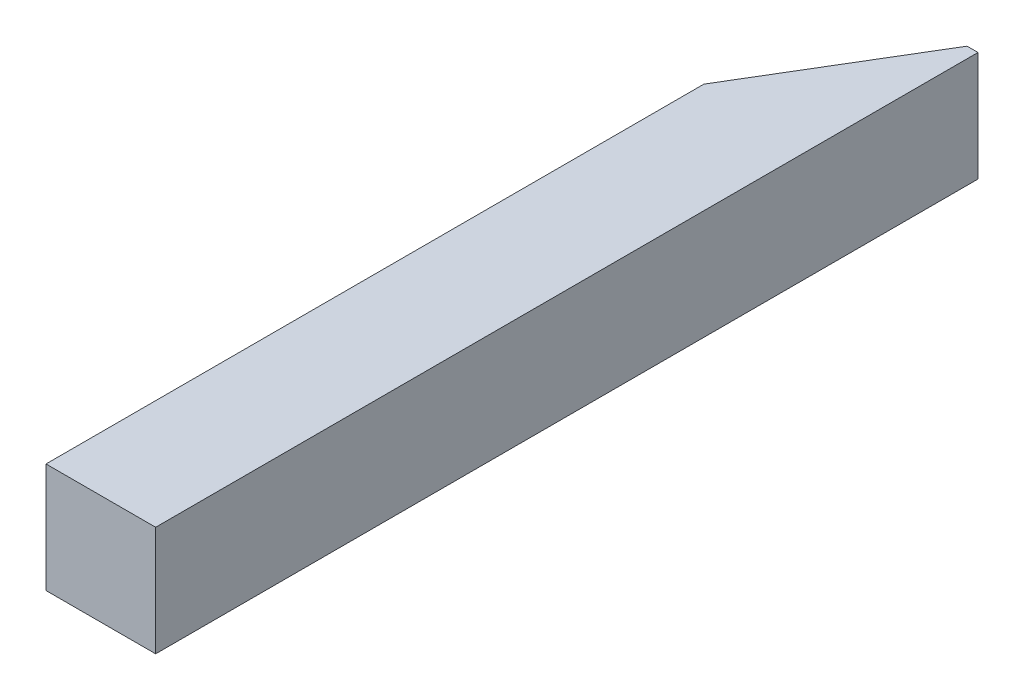
ISO-10303-21;
HEADER;
FILE_DESCRIPTION(('STEP AP214'),'2;1');
FILE_NAME('part.step','',(''),(''),'','','');
FILE_SCHEMA(('AUTOMOTIVE_DESIGN { 1 0 10303 214 1 1 1 1 }'));
ENDSEC;
DATA;
#1=APPLICATION_CONTEXT('core data for automotive mechanical design processes');
#2=APPLICATION_PROTOCOL_DEFINITION('international standard','automotive_design',2000,#1);
#3=PRODUCT_CONTEXT('',#1,'mechanical');
#4=PRODUCT('Part','Part','',(#3));
#5=PRODUCT_RELATED_PRODUCT_CATEGORY('part','',(#4));
#6=PRODUCT_DEFINITION_FORMATION('','',#4);
#7=PRODUCT_DEFINITION_CONTEXT('part definition',#1,'design');
#8=PRODUCT_DEFINITION('design','',#6,#7);
#9=PRODUCT_DEFINITION_SHAPE('','',#8);
#10=(LENGTH_UNIT() NAMED_UNIT(*) SI_UNIT(.MILLI.,.METRE.));
#11=(NAMED_UNIT(*) PLANE_ANGLE_UNIT() SI_UNIT($,.RADIAN.));
#12=(NAMED_UNIT(*) SI_UNIT($,.STERADIAN.) SOLID_ANGLE_UNIT());
#13=UNCERTAINTY_MEASURE_WITH_UNIT(LENGTH_MEASURE(1.E-05),#10,'distance_accuracy_value','');
#14=(GEOMETRIC_REPRESENTATION_CONTEXT(3) GLOBAL_UNCERTAINTY_ASSIGNED_CONTEXT((#13)) GLOBAL_UNIT_ASSIGNED_CONTEXT((#10,
#11,#12)) REPRESENTATION_CONTEXT('',''));
#15=CARTESIAN_POINT('',(0.,0.,0.));
#16=DIRECTION('',(0.,0.,1.));
#17=DIRECTION('',(1.,0.,0.));
#18=AXIS2_PLACEMENT_3D('',#15,#16,#17);
#19=CARTESIAN_POINT('',(0.,0.,150.));
#20=DIRECTION('',(1.,0.,0.));
#21=DIRECTION('',(0.,1.,0.));
#22=AXIS2_PLACEMENT_3D('',#19,#20,#21);
#23=PLANE('',#22);
#24=DIRECTION('',(0.,0.,-1.));
#25=VECTOR('',#24,1.);
#26=CARTESIAN_POINT('',(0.,0.,150.));
#27=LINE('',#26,#25);
#28=CARTESIAN_POINT('',(0.,0.,150.));
#29=VERTEX_POINT('',#28);
#30=CARTESIAN_POINT('',(0.,0.,30.));
#31=VERTEX_POINT('',#30);
#32=EDGE_CURVE('E11',#29,#31,#27,.T.);
#33=ORIENTED_EDGE('',*,*,#32,.T.);
#34=DIRECTION('',(0.,1.,0.));
#35=VECTOR('',#34,1.);
#36=CARTESIAN_POINT('',(0.,-20.,30.));
#37=LINE('',#36,#35);
#38=CARTESIAN_POINT('',(0.,-20.,30.));
#39=VERTEX_POINT('',#38);
#40=EDGE_CURVE('E42',#39,#31,#37,.T.);
#41=ORIENTED_EDGE('',*,*,#40,.F.);
#42=DIRECTION('',(0.,0.,-1.));
#43=VECTOR('',#42,1.);
#44=CARTESIAN_POINT('',(0.,-20.,150.));
#45=LINE('',#44,#43);
#46=CARTESIAN_POINT('',(0.,-20.,150.));
#47=VERTEX_POINT('',#46);
#48=EDGE_CURVE('E27',#47,#39,#45,.T.);
#49=ORIENTED_EDGE('',*,*,#48,.F.);
#50=DIRECTION('',(0.,-1.,0.));
#51=VECTOR('',#50,1.);
#52=CARTESIAN_POINT('',(0.,0.,150.));
#53=LINE('',#52,#51);
#54=EDGE_CURVE('E108',#29,#47,#53,.T.);
#55=ORIENTED_EDGE('',*,*,#54,.F.);
#56=EDGE_LOOP('',(#33,#41,#49,#55));
#57=FACE_BOUND('',#56,.T.);
#58=ADVANCED_FACE('F16',(#57),#23,.F.);
#59=CARTESIAN_POINT('',(0.,-20.,150.));
#60=DIRECTION('',(0.,1.,0.));
#61=DIRECTION('',(1.,0.,0.));
#62=AXIS2_PLACEMENT_3D('',#59,#60,#61);
#63=PLANE('',#62);
#64=ORIENTED_EDGE('',*,*,#48,.T.);
#65=DIRECTION('',(0.514495755427527,0.,-0.857492925712544));
#66=VECTOR('',#65,1.);
#67=CARTESIAN_POINT('',(18.,-20.,0.));
#68=LINE('',#67,#66);
#69=CARTESIAN_POINT('',(18.,-20.,0.));
#70=VERTEX_POINT('',#69);
#71=EDGE_CURVE('E94',#39,#70,#68,.T.);
#72=ORIENTED_EDGE('',*,*,#71,.T.);
#73=DIRECTION('',(1.,0.,0.));
#74=VECTOR('',#73,1.);
#75=CARTESIAN_POINT('',(0.,-20.,0.));
#76=LINE('',#75,#74);
#77=CARTESIAN_POINT('',(20.,-20.,0.));
#78=VERTEX_POINT('',#77);
#79=EDGE_CURVE('E91',#70,#78,#76,.T.);
#80=ORIENTED_EDGE('',*,*,#79,.T.);
#81=DIRECTION('',(0.,0.,-1.));
#82=VECTOR('',#81,1.);
#83=CARTESIAN_POINT('',(20.,-20.,150.));
#84=LINE('',#83,#82);
#85=CARTESIAN_POINT('',(20.,-20.,150.));
#86=VERTEX_POINT('',#85);
#87=EDGE_CURVE('E78',#86,#78,#84,.T.);
#88=ORIENTED_EDGE('',*,*,#87,.F.);
#89=DIRECTION('',(1.,0.,0.));
#90=VECTOR('',#89,1.);
#91=CARTESIAN_POINT('',(0.,-20.,150.));
#92=LINE('',#91,#90);
#93=EDGE_CURVE('E111',#47,#86,#92,.T.);
#94=ORIENTED_EDGE('',*,*,#93,.F.);
#95=EDGE_LOOP('',(#64,#72,#80,#88,#94));
#96=FACE_BOUND('',#95,.T.);
#97=ADVANCED_FACE('F93',(#96),#63,.F.);
#98=CARTESIAN_POINT('',(20.,0.,150.));
#99=DIRECTION('',(-1.,0.,0.));
#100=DIRECTION('',(0.,1.,0.));
#101=AXIS2_PLACEMENT_3D('',#98,#99,#100);
#102=PLANE('',#101);
#103=DIRECTION('',(0.,1.,0.));
#104=VECTOR('',#103,1.);
#105=CARTESIAN_POINT('',(20.,0.,0.));
#106=LINE('',#105,#104);
#107=CARTESIAN_POINT('',(20.,0.,0.));
#108=VERTEX_POINT('',#107);
#109=EDGE_CURVE('E83',#78,#108,#106,.T.);
#110=ORIENTED_EDGE('',*,*,#109,.T.);
#111=DIRECTION('',(0.,0.,-1.));
#112=VECTOR('',#111,1.);
#113=CARTESIAN_POINT('',(20.,0.,150.));
#114=LINE('',#113,#112);
#115=CARTESIAN_POINT('',(20.,0.,150.));
#116=VERTEX_POINT('',#115);
#117=EDGE_CURVE('E110',#116,#108,#114,.T.);
#118=ORIENTED_EDGE('',*,*,#117,.F.);
#119=DIRECTION('',(0.,1.,0.));
#120=VECTOR('',#119,1.);
#121=CARTESIAN_POINT('',(20.,0.,150.));
#122=LINE('',#121,#120);
#123=EDGE_CURVE('E20',#86,#116,#122,.T.);
#124=ORIENTED_EDGE('',*,*,#123,.F.);
#125=ORIENTED_EDGE('',*,*,#87,.T.);
#126=EDGE_LOOP('',(#110,#118,#124,#125));
#127=FACE_BOUND('',#126,.T.);
#128=ADVANCED_FACE('F80',(#127),#102,.F.);
#129=CARTESIAN_POINT('',(0.,0.,150.));
#130=DIRECTION('',(0.,-1.,0.));
#131=DIRECTION('',(0.,0.,-1.));
#132=AXIS2_PLACEMENT_3D('',#129,#130,#131);
#133=PLANE('',#132);
#134=DIRECTION('',(-1.,0.,0.));
#135=VECTOR('',#134,1.);
#136=CARTESIAN_POINT('',(0.,0.,0.));
#137=LINE('',#136,#135);
#138=CARTESIAN_POINT('',(18.,0.,0.));
#139=VERTEX_POINT('',#138);
#140=EDGE_CURVE('E88',#108,#139,#137,.T.);
#141=ORIENTED_EDGE('',*,*,#140,.T.);
#142=DIRECTION('',(0.514495755427527,0.,-0.857492925712544));
#143=VECTOR('',#142,1.);
#144=CARTESIAN_POINT('',(18.,0.,0.));
#145=LINE('',#144,#143);
#146=EDGE_CURVE('E112',#31,#139,#145,.T.);
#147=ORIENTED_EDGE('',*,*,#146,.F.);
#148=ORIENTED_EDGE('',*,*,#32,.F.);
#149=DIRECTION('',(-1.,0.,0.));
#150=VECTOR('',#149,1.);
#151=CARTESIAN_POINT('',(0.,0.,150.));
#152=LINE('',#151,#150);
#153=EDGE_CURVE('E128',#116,#29,#152,.T.);
#154=ORIENTED_EDGE('',*,*,#153,.F.);
#155=ORIENTED_EDGE('',*,*,#117,.T.);
#156=EDGE_LOOP('',(#141,#147,#148,#154,#155));
#157=FACE_BOUND('',#156,.T.);
#158=ADVANCED_FACE('F137',(#157),#133,.F.);
#159=CARTESIAN_POINT('',(0.,0.,150.));
#160=DIRECTION('',(0.,0.,1.));
#161=DIRECTION('',(1.,0.,0.));
#162=AXIS2_PLACEMENT_3D('',#159,#160,#161);
#163=PLANE('',#162);
#164=ORIENTED_EDGE('',*,*,#54,.T.);
#165=ORIENTED_EDGE('',*,*,#93,.T.);
#166=ORIENTED_EDGE('',*,*,#123,.T.);
#167=ORIENTED_EDGE('',*,*,#153,.T.);
#168=EDGE_LOOP('',(#164,#165,#166,#167));
#169=FACE_BOUND('',#168,.T.);
#170=ADVANCED_FACE('F141',(#169),#163,.T.);
#171=CARTESIAN_POINT('',(0.,0.,0.));
#172=DIRECTION('',(0.,0.,1.));
#173=DIRECTION('',(1.,0.,0.));
#174=AXIS2_PLACEMENT_3D('',#171,#172,#173);
#175=PLANE('',#174);
#176=ORIENTED_EDGE('',*,*,#79,.F.);
#177=DIRECTION('',(0.,1.,0.));
#178=VECTOR('',#177,1.);
#179=CARTESIAN_POINT('',(18.,-20.,0.));
#180=LINE('',#179,#178);
#181=EDGE_CURVE('E114',#70,#139,#180,.T.);
#182=ORIENTED_EDGE('',*,*,#181,.T.);
#183=ORIENTED_EDGE('',*,*,#140,.F.);
#184=ORIENTED_EDGE('',*,*,#109,.F.);
#185=EDGE_LOOP('',(#176,#182,#183,#184));
#186=FACE_BOUND('',#185,.T.);
#187=ADVANCED_FACE('F100',(#186),#175,.F.);
#188=CARTESIAN_POINT('',(18.,-20.,0.));
#189=DIRECTION('',(0.857492925712544,0.,0.514495755427527));
#190=DIRECTION('',(0.,-1.,0.));
#191=AXIS2_PLACEMENT_3D('',#188,#189,#190);
#192=PLANE('',#191);
#193=ORIENTED_EDGE('',*,*,#146,.T.);
#194=ORIENTED_EDGE('',*,*,#181,.F.);
#195=ORIENTED_EDGE('',*,*,#71,.F.);
#196=ORIENTED_EDGE('',*,*,#40,.T.);
#197=EDGE_LOOP('',(#193,#194,#195,#196));
#198=FACE_BOUND('',#197,.T.);
#199=ADVANCED_FACE('F18',(#198),#192,.F.);
#200=CLOSED_SHELL('',(#58,#97,#128,#158,#170,#187,#199));
#201=MANIFOLD_SOLID_BREP('B1',#200);
#202=ADVANCED_BREP_SHAPE_REPRESENTATION('',(#18,#201),#14);
#203=SHAPE_DEFINITION_REPRESENTATION(#9,#202);
ENDSEC;
END-ISO-10303-21;
